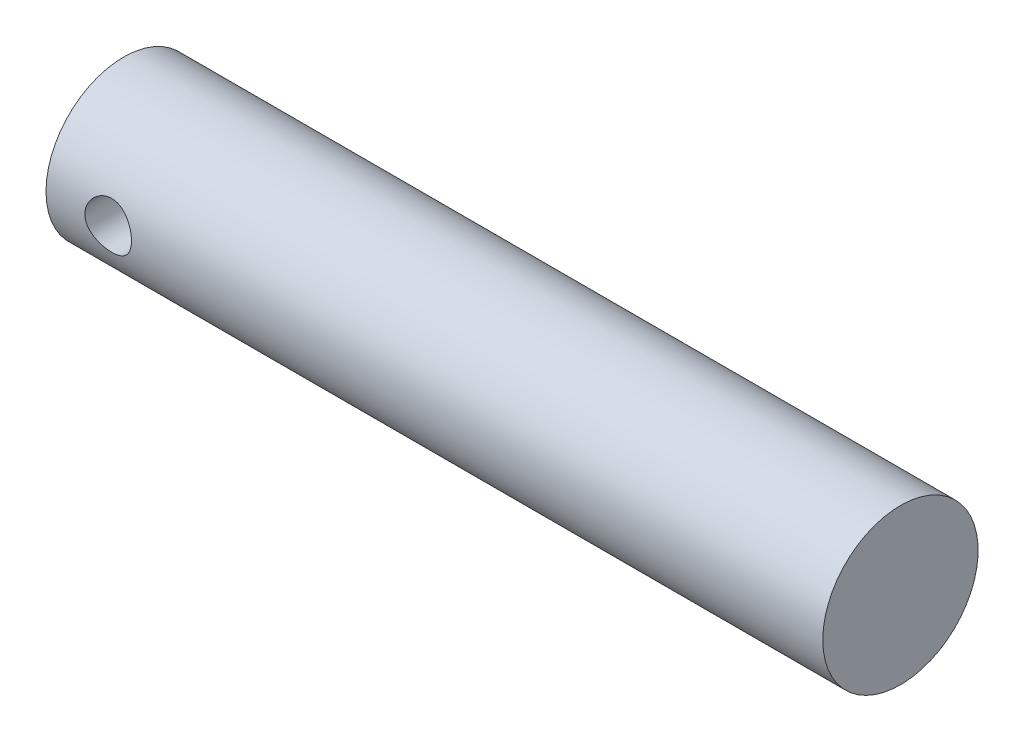
ISO-10303-21;
HEADER;
FILE_DESCRIPTION(('STEP AP214'),'2;1');
FILE_NAME('part.step','',(''),(''),'','','');
FILE_SCHEMA(('AUTOMOTIVE_DESIGN { 1 0 10303 214 1 1 1 1 }'));
ENDSEC;
DATA;
#1=APPLICATION_CONTEXT('core data for automotive mechanical design processes');
#2=APPLICATION_PROTOCOL_DEFINITION('international standard','automotive_design',2000,#1);
#3=PRODUCT_CONTEXT('',#1,'mechanical');
#4=PRODUCT('Part','Part','',(#3));
#5=PRODUCT_RELATED_PRODUCT_CATEGORY('part','',(#4));
#6=PRODUCT_DEFINITION_FORMATION('','',#4);
#7=PRODUCT_DEFINITION_CONTEXT('part definition',#1,'design');
#8=PRODUCT_DEFINITION('design','',#6,#7);
#9=PRODUCT_DEFINITION_SHAPE('','',#8);
#10=(LENGTH_UNIT() NAMED_UNIT(*) SI_UNIT(.MILLI.,.METRE.));
#11=(NAMED_UNIT(*) PLANE_ANGLE_UNIT() SI_UNIT($,.RADIAN.));
#12=(NAMED_UNIT(*) SI_UNIT($,.STERADIAN.) SOLID_ANGLE_UNIT());
#13=UNCERTAINTY_MEASURE_WITH_UNIT(LENGTH_MEASURE(1.E-05),#10,'distance_accuracy_value','');
#14=(GEOMETRIC_REPRESENTATION_CONTEXT(3) GLOBAL_UNCERTAINTY_ASSIGNED_CONTEXT((#13)) GLOBAL_UNIT_ASSIGNED_CONTEXT((#10,
#11,#12)) REPRESENTATION_CONTEXT('',''));
#15=CARTESIAN_POINT('',(0.,0.,0.));
#16=DIRECTION('',(0.,0.,1.));
#17=DIRECTION('',(1.,0.,0.));
#18=AXIS2_PLACEMENT_3D('',#15,#16,#17);
#19=CARTESIAN_POINT('',(0.,0.,0.));
#20=DIRECTION('',(-1.,0.,0.));
#21=DIRECTION('',(0.,0.,1.));
#22=AXIS2_PLACEMENT_3D('',#19,#20,#21);
#23=CYLINDRICAL_SURFACE('',#22,10.);
#24=CARTESIAN_POINT('',(0.,0.,0.));
#25=DIRECTION('',(-1.,0.,0.));
#26=DIRECTION('',(0.,0.,1.));
#27=AXIS2_PLACEMENT_3D('',#24,#25,#26);
#28=CIRCLE('',#27,10.);
#29=CARTESIAN_POINT('',(0.,0.,10.));
#30=VERTEX_POINT('',#29);
#31=EDGE_CURVE('E10',#30,#30,#28,.T.);
#32=ORIENTED_EDGE('',*,*,#31,.F.);
#33=EDGE_LOOP('',(#32));
#34=FACE_BOUND('',#33,.T.);
#35=CARTESIAN_POINT('',(100.,0.,0.));
#36=DIRECTION('',(-1.,0.,0.));
#37=DIRECTION('',(0.,0.,1.));
#38=AXIS2_PLACEMENT_3D('',#35,#36,#37);
#39=CIRCLE('',#38,10.);
#40=CARTESIAN_POINT('',(100.,0.,10.));
#41=VERTEX_POINT('',#40);
#42=EDGE_CURVE('E39',#41,#41,#39,.T.);
#43=ORIENTED_EDGE('',*,*,#42,.T.);
#44=EDGE_LOOP('',(#43));
#45=FACE_BOUND('',#44,.T.);
#46=CARTESIAN_POINT('',(11.,0.,-10.));
#47=CARTESIAN_POINT('',(10.9999980050302,-0.1645772255066,-9.999998585011));
#48=CARTESIAN_POINT('',(10.9864122727521,-0.329174636703059,-9.99589831387907));
#49=CARTESIAN_POINT('',(10.9325572915558,-0.653576250609761,-9.97994211187381));
#50=CARTESIAN_POINT('',(10.8922800839533,-0.813379008822839,-9.96808386779384));
#51=CARTESIAN_POINT('',(10.7865079661795,-1.12346541550905,-9.93791105003673));
#52=CARTESIAN_POINT('',(10.7210502607621,-1.27376272879075,-9.91960600500851));
#53=CARTESIAN_POINT('',(10.5669278138883,-1.56124836210626,-9.8784421847529));
#54=CARTESIAN_POINT('',(10.4782599852092,-1.69843493493934,-9.85558280384133));
#55=CARTESIAN_POINT('',(10.2775519850547,-1.95974359436749,-9.80701474385548));
#56=CARTESIAN_POINT('',(10.1649667482282,-2.08343614248868,-9.78124767314073));
#57=CARTESIAN_POINT('',(9.92078154017963,-2.31049841846647,-9.73011668420884));
#58=CARTESIAN_POINT('',(9.78917837575008,-2.41386472654882,-9.70475283449003));
#59=CARTESIAN_POINT('',(9.50705849392478,-2.59960075447415,-9.65668227987544));
#60=CARTESIAN_POINT('',(9.35618307801852,-2.68144618044427,-9.63404813327749));
#61=CARTESIAN_POINT('',(9.04202149153941,-2.81842789549521,-9.59487240788062));
#62=CARTESIAN_POINT('',(8.87873831214405,-2.87357059839946,-9.57832936626621));
#63=CARTESIAN_POINT('',(8.54921946773908,-2.95403267365303,-9.55381741676868));
#64=CARTESIAN_POINT('',(8.38319451227211,-2.98014392469355,-9.54562138649066));
#65=CARTESIAN_POINT('',(8.04893368756647,-3.00427461229344,-9.53805579499534));
#66=CARTESIAN_POINT('',(7.88069836388182,-3.00230085522157,-9.53868409521142));
#67=CARTESIAN_POINT('',(7.55323218278303,-2.97093954399623,-9.54849488135555));
#68=CARTESIAN_POINT('',(7.39389549927552,-2.9425441052537,-9.55736777198281));
#69=CARTESIAN_POINT('',(7.08236042745308,-2.86074840854112,-9.58216712457248));
#70=CARTESIAN_POINT('',(6.93016274525133,-2.80734568283282,-9.59809428264701));
#71=CARTESIAN_POINT('',(6.63479930067852,-2.67632053307363,-9.63545466149946));
#72=CARTESIAN_POINT('',(6.49178583208948,-2.59837633869285,-9.65696032231904));
#73=CARTESIAN_POINT('',(6.22053595597962,-2.42070445177367,-9.70301974000129));
#74=CARTESIAN_POINT('',(6.09230314117245,-2.32097148005177,-9.72757423493982));
#75=CARTESIAN_POINT('',(5.84862761847596,-2.09762581531093,-9.77822022595874));
#76=CARTESIAN_POINT('',(5.73394267194066,-1.97318981493394,-9.80433308620995));
#77=CARTESIAN_POINT('',(5.5268920318715,-1.70652651862793,-9.85424488126517));
#78=CARTESIAN_POINT('',(5.43452774317115,-1.56429810372177,-9.8780436703682));
#79=CARTESIAN_POINT('',(5.27428015507054,-1.26471007668561,-9.92086320138941));
#80=CARTESIAN_POINT('',(5.20656496750028,-1.1072554994959,-9.93985087336628));
#81=CARTESIAN_POINT('',(5.09880081980074,-0.782490831207038,-9.97067043664444));
#82=CARTESIAN_POINT('',(5.05874414293502,-0.615183503179162,-9.98250432373999));
#83=CARTESIAN_POINT('',(5.00869564420121,-0.281904485336663,-9.99736729287076));
#84=CARTESIAN_POINT('',(4.99767682839678,-0.116100195202374,-10.0006970083558));
#85=CARTESIAN_POINT('',(5.00313831142416,0.214999211646766,-9.99905846483519));
#86=CARTESIAN_POINT('',(5.01961493930289,0.380294393381561,-9.99409131355514));
#87=CARTESIAN_POINT('',(5.07876922222299,0.701807210619393,-9.97661393974324));
#88=CARTESIAN_POINT('',(5.12084677516174,0.858145545228337,-9.96427659598828));
#89=CARTESIAN_POINT('',(5.2292864655564,1.16150927790904,-9.9334869568307));
#90=CARTESIAN_POINT('',(5.29565152207572,1.30853355405117,-9.91503392642187));
#91=CARTESIAN_POINT('',(5.45250633096227,1.5928743789221,-9.87339308702631));
#92=CARTESIAN_POINT('',(5.54351868189596,1.72988765239933,-9.8501056165928));
#93=CARTESIAN_POINT('',(5.74644950810561,1.9870466159603,-9.80146937528704));
#94=CARTESIAN_POINT('',(5.8583732237753,2.10718806471188,-9.77612008862419));
#95=CARTESIAN_POINT('',(6.10477461673874,2.33171489102052,-9.72506343738006));
#96=CARTESIAN_POINT('',(6.23992375154365,2.43536962463001,-9.69937650065513));
#97=CARTESIAN_POINT('',(6.52625587802689,2.61857990144313,-9.65153030477949));
#98=CARTESIAN_POINT('',(6.67743844911576,2.69813607658965,-9.62937095313121));
#99=CARTESIAN_POINT('',(6.99106498251004,2.83034694254316,-9.59134379226309));
#100=CARTESIAN_POINT('',(7.15345237307567,2.88312693874021,-9.575446756735));
#101=CARTESIAN_POINT('',(7.48537593786047,2.96043461630306,-9.55183188739737));
#102=CARTESIAN_POINT('',(7.65490964156607,2.98497197957849,-9.54411125069387));
#103=CARTESIAN_POINT('',(7.98872303677684,3.0044396896993,-9.53799944941558));
#104=CARTESIAN_POINT('',(8.15292730209885,3.00056110615887,-9.53923294700395));
#105=CARTESIAN_POINT('',(8.47822820680123,2.9661501088861,-9.54998802392188));
#106=CARTESIAN_POINT('',(8.63932497036103,2.93561876249407,-9.55950927135901));
#107=CARTESIAN_POINT('',(8.95189079826335,2.84953777608686,-9.58551527389243));
#108=CARTESIAN_POINT('',(9.10345457471739,2.79430351014248,-9.60191209104934));
#109=CARTESIAN_POINT('',(9.39528487764144,2.66063014242147,-9.63980557805265));
#110=CARTESIAN_POINT('',(9.53554923528315,2.58218659925722,-9.6613032238508));
#111=CARTESIAN_POINT('',(9.80632623305253,2.40097527610175,-9.70795352855338));
#112=CARTESIAN_POINT('',(9.93629752252037,2.29742552185996,-9.7332108032858));
#113=CARTESIAN_POINT('',(10.1774049966162,2.07034869259555,-9.78402640899066));
#114=CARTESIAN_POINT('',(10.2885362789356,1.94681643426898,-9.80958481647543));
#115=CARTESIAN_POINT('',(10.4920468245899,1.67893152436652,-9.85901873141573));
#116=CARTESIAN_POINT('',(10.5837828937109,1.53407577158122,-9.88282319531421));
#117=CARTESIAN_POINT('',(10.7414703398081,1.23028274796705,-9.92521360911553));
#118=CARTESIAN_POINT('',(10.807433776549,1.07135210599791,-9.94380199862114));
#119=CARTESIAN_POINT('',(10.9057905513055,0.761515425310563,-9.97204349938618));
#120=CARTESIAN_POINT('',(10.9410233457665,0.611573923908468,-9.98244054762139));
#121=CARTESIAN_POINT('',(10.9881270504832,0.307760390461558,-9.9964188898898));
#122=CARTESIAN_POINT('',(11.0000018654096,0.153889019716279,-10.0000013230948));
#123=CARTESIAN_POINT('',(11.,0.,-10.));
#124=B_SPLINE_CURVE_WITH_KNOTS('',3,(#46,#47,#48,#49,#50,#51,#52,#53,#54,#55,#56,#57,#58,#59,
#60,#61,#62,#63,#64,#65,#66,#67,#68,#69,#70,#71,#72,#73,#74,#75,#76,#77,#78,#79,#80,#81,#82,#83,
#84,#85,#86,#87,#88,#89,#90,#91,#92,#93,#94,#95,#96,#97,#98,#99,#100,#101,#102,#103,#104,#105,
#106,#107,#108,#109,#110,#111,#112,#113,#114,#115,#116,#117,#118,#119,#120,#121,#122,#123),
.UNSPECIFIED.,.T.,.F.,(4,2,2,2,2,2,2,2,2,2,2,2,2,2,2,2,2,2,2,2,2,2,2,2,2,2,2,2,2,2,2,2,2,2,2,2,
2,2,4),(0.,0.493166407225221,0.986479929691998,1.47906735260175,1.9717203288254,
2.47711205896383,2.98258874577266,3.49942962008218,4.01614629086447,4.51839378713198,
5.02051956638178,5.50452033395352,5.98856887316002,6.47924852894239,6.9700472031711,
7.48134208096333,7.99266913062143,8.50742093763377,9.02202907057615,9.51817618877089,
10.0142570710065,10.4991349336465,10.9840710918746,11.4802261140582,11.9765056400038,
12.4908080064564,13.0050968850536,13.516956299025,14.0286401892056,14.5190031093854,
15.0093463933232,15.4936008081456,15.9779479511533,16.4799385136898,16.9820594980412,
17.4988599232246,18.0154182319959,18.4766338387004,18.9377723390687),.UNSPECIFIED.);
#125=CARTESIAN_POINT('',(11.,0.,-10.));
#126=VERTEX_POINT('',#125);
#127=EDGE_CURVE('E47',#126,#126,#124,.T.);
#128=ORIENTED_EDGE('',*,*,#127,.F.);
#129=EDGE_LOOP('',(#128));
#130=FACE_BOUND('',#129,.T.);
#131=CARTESIAN_POINT('',(5.,0.,10.));
#132=CARTESIAN_POINT('',(5.00000199496977,0.1645772255066,9.999998585011));
#133=CARTESIAN_POINT('',(5.01358772724793,0.329174636703059,9.99589831387907));
#134=CARTESIAN_POINT('',(5.0674427084442,0.653576250609761,9.97994211187381));
#135=CARTESIAN_POINT('',(5.10771991604669,0.81337900882284,9.96808386779384));
#136=CARTESIAN_POINT('',(5.21349203382053,1.12346541550905,9.93791105003673));
#137=CARTESIAN_POINT('',(5.27894973923788,1.27376272879075,9.91960600500851));
#138=CARTESIAN_POINT('',(5.43307218611167,1.56124836210626,9.8784421847529));
#139=CARTESIAN_POINT('',(5.52174001479083,1.69843493493934,9.85558280384133));
#140=CARTESIAN_POINT('',(5.72244801494534,1.95974359436749,9.80701474385548));
#141=CARTESIAN_POINT('',(5.83503325177183,2.08343614248868,9.78124767314073));
#142=CARTESIAN_POINT('',(6.07921845982037,2.31049841846647,9.73011668420884));
#143=CARTESIAN_POINT('',(6.21082162424992,2.41386472654881,9.70475283449003));
#144=CARTESIAN_POINT('',(6.49294150607523,2.59960075447415,9.65668227987544));
#145=CARTESIAN_POINT('',(6.64381692198148,2.68144618044427,9.63404813327749));
#146=CARTESIAN_POINT('',(6.95797850846059,2.81842789549521,9.59487240788062));
#147=CARTESIAN_POINT('',(7.12126168785595,2.87357059839946,9.57832936626621));
#148=CARTESIAN_POINT('',(7.45078053226092,2.95403267365303,9.55381741676868));
#149=CARTESIAN_POINT('',(7.61680548772789,2.98014392469355,9.54562138649066));
#150=CARTESIAN_POINT('',(7.95106631243353,3.00427461229344,9.53805579499534));
#151=CARTESIAN_POINT('',(8.11930163611818,3.00230085522157,9.53868409521142));
#152=CARTESIAN_POINT('',(8.44676781721697,2.97093954399623,9.54849488135555));
#153=CARTESIAN_POINT('',(8.60610450072448,2.9425441052537,9.55736777198281));
#154=CARTESIAN_POINT('',(8.91763957254692,2.86074840854112,9.58216712457248));
#155=CARTESIAN_POINT('',(9.06983725474867,2.80734568283282,9.59809428264701));
#156=CARTESIAN_POINT('',(9.36520069932148,2.67632053307363,9.63545466149946));
#157=CARTESIAN_POINT('',(9.50821416791053,2.59837633869285,9.65696032231904));
#158=CARTESIAN_POINT('',(9.77946404402038,2.42070445177366,9.70301974000129));
#159=CARTESIAN_POINT('',(9.90769685882755,2.32097148005177,9.72757423493982));
#160=CARTESIAN_POINT('',(10.151372381524,2.09762581531093,9.77822022595874));
#161=CARTESIAN_POINT('',(10.2660573280593,1.97318981493394,9.80433308620996));
#162=CARTESIAN_POINT('',(10.4731079681285,1.70652651862793,9.85424488126517));
#163=CARTESIAN_POINT('',(10.5654722568289,1.56429810372178,9.8780436703682));
#164=CARTESIAN_POINT('',(10.7257198449295,1.26471007668561,9.92086320138941));
#165=CARTESIAN_POINT('',(10.7934350324997,1.1072554994959,9.93985087336628));
#166=CARTESIAN_POINT('',(10.9011991801993,0.782490831207038,9.97067043664444));
#167=CARTESIAN_POINT('',(10.941255857065,0.615183503179163,9.98250432373999));
#168=CARTESIAN_POINT('',(10.9913043557988,0.281904485336663,9.99736729287076));
#169=CARTESIAN_POINT('',(11.0023231716032,0.116100195202373,10.0006970083558));
#170=CARTESIAN_POINT('',(10.9968616885758,-0.214999211646767,9.99905846483519));
#171=CARTESIAN_POINT('',(10.9803850606971,-0.380294393381562,9.99409131355514));
#172=CARTESIAN_POINT('',(10.921230777777,-0.701807210619394,9.97661393974324));
#173=CARTESIAN_POINT('',(10.8791532248383,-0.858145545228339,9.96427659598828));
#174=CARTESIAN_POINT('',(10.7707135344436,-1.16150927790904,9.9334869568307));
#175=CARTESIAN_POINT('',(10.7043484779243,-1.30853355405117,9.91503392642187));
#176=CARTESIAN_POINT('',(10.5474936690377,-1.5928743789221,9.87339308702631));
#177=CARTESIAN_POINT('',(10.456481318104,-1.72988765239934,9.8501056165928));
#178=CARTESIAN_POINT('',(10.2535504918944,-1.9870466159603,9.80146937528704));
#179=CARTESIAN_POINT('',(10.1416267762247,-2.10718806471188,9.77612008862419));
#180=CARTESIAN_POINT('',(9.89522538326126,-2.33171489102052,9.72506343738006));
#181=CARTESIAN_POINT('',(9.76007624845635,-2.43536962463001,9.69937650065513));
#182=CARTESIAN_POINT('',(9.47374412197311,-2.61857990144313,9.65153030477949));
#183=CARTESIAN_POINT('',(9.32256155088424,-2.69813607658965,9.62937095313121));
#184=CARTESIAN_POINT('',(9.00893501748996,-2.83034694254316,9.59134379226309));
#185=CARTESIAN_POINT('',(8.84654762692434,-2.88312693874021,9.575446756735));
#186=CARTESIAN_POINT('',(8.51462406213953,-2.96043461630306,9.55183188739737));
#187=CARTESIAN_POINT('',(8.34509035843393,-2.98497197957849,9.54411125069387));
#188=CARTESIAN_POINT('',(8.01127696322316,-3.0044396896993,9.53799944941558));
#189=CARTESIAN_POINT('',(7.84707269790116,-3.00056110615887,9.53923294700395));
#190=CARTESIAN_POINT('',(7.52177179319877,-2.9661501088861,9.54998802392188));
#191=CARTESIAN_POINT('',(7.36067502963898,-2.93561876249407,9.55950927135901));
#192=CARTESIAN_POINT('',(7.04810920173665,-2.84953777608686,9.58551527389243));
#193=CARTESIAN_POINT('',(6.89654542528261,-2.79430351014248,9.60191209104934));
#194=CARTESIAN_POINT('',(6.60471512235855,-2.66063014242147,9.63980557805265));
#195=CARTESIAN_POINT('',(6.46445076471685,-2.58218659925722,9.6613032238508));
#196=CARTESIAN_POINT('',(6.19367376694747,-2.40097527610175,9.70795352855338));
#197=CARTESIAN_POINT('',(6.06370247747963,-2.29742552185996,9.7332108032858));
#198=CARTESIAN_POINT('',(5.82259500338382,-2.07034869259555,9.78402640899066));
#199=CARTESIAN_POINT('',(5.71146372106436,-1.94681643426898,9.80958481647543));
#200=CARTESIAN_POINT('',(5.50795317541007,-1.67893152436652,9.85901873141573));
#201=CARTESIAN_POINT('',(5.41621710628906,-1.53407577158122,9.88282319531421));
#202=CARTESIAN_POINT('',(5.25852966019192,-1.23028274796705,9.92521360911553));
#203=CARTESIAN_POINT('',(5.19256622345098,-1.07135210599791,9.94380199862114));
#204=CARTESIAN_POINT('',(5.09420944869451,-0.761515425310564,9.97204349938618));
#205=CARTESIAN_POINT('',(5.05897665423351,-0.611573923908468,9.98244054762139));
#206=CARTESIAN_POINT('',(5.01187294951685,-0.307760390461558,9.9964188898898));
#207=CARTESIAN_POINT('',(4.99999813459036,-0.153889019716279,10.0000013230948));
#208=CARTESIAN_POINT('',(5.,0.,10.));
#209=B_SPLINE_CURVE_WITH_KNOTS('',3,(#131,#132,#133,#134,#135,#136,#137,#138,#139,#140,#141,
#142,#143,#144,#145,#146,#147,#148,#149,#150,#151,#152,#153,#154,#155,#156,#157,#158,#159,#160,
#161,#162,#163,#164,#165,#166,#167,#168,#169,#170,#171,#172,#173,#174,#175,#176,#177,#178,#179,
#180,#181,#182,#183,#184,#185,#186,#187,#188,#189,#190,#191,#192,#193,#194,#195,#196,#197,#198,
#199,#200,#201,#202,#203,#204,#205,#206,#207,#208),.UNSPECIFIED.,.T.,.F.,(4,2,2,2,2,2,2,2,2,2,2,
2,2,2,2,2,2,2,2,2,2,2,2,2,2,2,2,2,2,2,2,2,2,2,2,2,2,2,4),(0.,0.493166407225221,
0.986479929691998,1.47906735260175,1.9717203288254,2.47711205896383,2.98258874577266,
3.49942962008218,4.01614629086447,4.51839378713197,5.02051956638178,5.50452033395352,
5.98856887316002,6.47924852894239,6.97004720317111,7.48134208096333,7.99266913062143,
8.50742093763377,9.02202907057615,9.5181761887709,10.0142570710065,10.4991349336465,
10.9840710918746,11.4802261140582,11.9765056400038,12.4908080064564,13.0050968850536,
13.516956299025,14.0286401892057,14.5190031093854,15.0093463933232,15.4936008081456,
15.9779479511533,16.4799385136898,16.9820594980412,17.4988599232246,18.0154182319959,
18.4766338387004,18.9377723390687),.UNSPECIFIED.);
#210=CARTESIAN_POINT('',(5.,0.,10.));
#211=VERTEX_POINT('',#210);
#212=EDGE_CURVE('E43',#211,#211,#209,.T.);
#213=ORIENTED_EDGE('',*,*,#212,.T.);
#214=EDGE_LOOP('',(#213));
#215=FACE_BOUND('',#214,.T.);
#216=ADVANCED_FACE('F32',(#34,#45,#130,#215),#23,.T.);
#217=CARTESIAN_POINT('',(0.,0.,0.));
#218=DIRECTION('',(1.,0.,0.));
#219=DIRECTION('',(0.,0.,-1.));
#220=AXIS2_PLACEMENT_3D('',#217,#218,#219);
#221=PLANE('',#220);
#222=ORIENTED_EDGE('',*,*,#31,.T.);
#223=EDGE_LOOP('',(#222));
#224=FACE_BOUND('',#223,.T.);
#225=ADVANCED_FACE('F34',(#224),#221,.F.);
#226=CARTESIAN_POINT('',(100.,0.,0.));
#227=DIRECTION('',(-1.,0.,0.));
#228=DIRECTION('',(0.,0.,1.));
#229=AXIS2_PLACEMENT_3D('',#226,#227,#228);
#230=PLANE('',#229);
#231=ORIENTED_EDGE('',*,*,#42,.F.);
#232=EDGE_LOOP('',(#231));
#233=FACE_BOUND('',#232,.T.);
#234=ADVANCED_FACE('F67',(#233),#230,.F.);
#235=CARTESIAN_POINT('',(8.,0.,10.001));
#236=DIRECTION('',(0.,0.,-1.));
#237=DIRECTION('',(-1.,0.,0.));
#238=AXIS2_PLACEMENT_3D('',#235,#236,#237);
#239=CYLINDRICAL_SURFACE('',#238,3.);
#240=ORIENTED_EDGE('',*,*,#212,.F.);
#241=EDGE_LOOP('',(#240));
#242=FACE_BOUND('',#241,.T.);
#243=ORIENTED_EDGE('',*,*,#127,.T.);
#244=EDGE_LOOP('',(#243));
#245=FACE_BOUND('',#244,.T.);
#246=ADVANCED_FACE('F60',(#242,#245),#239,.F.);
#247=CLOSED_SHELL('',(#216,#225,#234,#246));
#248=MANIFOLD_SOLID_BREP('B2',#247);
#249=ADVANCED_BREP_SHAPE_REPRESENTATION('',(#18,#248),#14);
#250=SHAPE_DEFINITION_REPRESENTATION(#9,#249);
ENDSEC;
END-ISO-10303-21;
